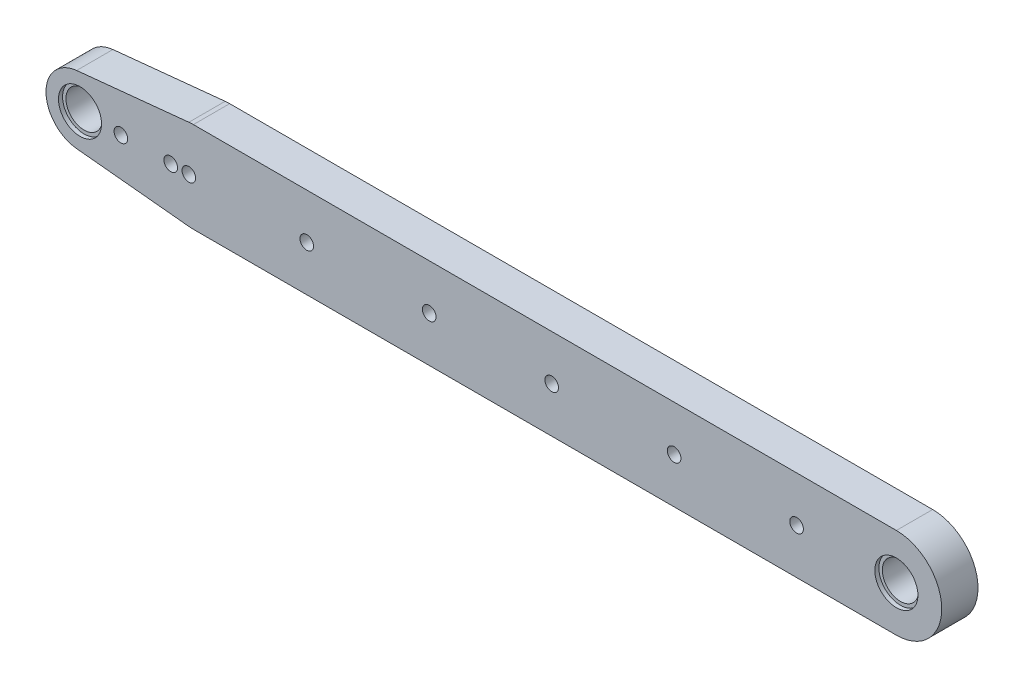
ISO-10303-21;
HEADER;
FILE_DESCRIPTION(('STEP AP214'),'2;1');
FILE_NAME('part.step','',(''),(''),'','','');
FILE_SCHEMA(('AUTOMOTIVE_DESIGN { 1 0 10303 214 1 1 1 1 }'));
ENDSEC;
DATA;
#1=APPLICATION_CONTEXT('core data for automotive mechanical design processes');
#2=APPLICATION_PROTOCOL_DEFINITION('international standard','automotive_design',2000,#1);
#3=PRODUCT_CONTEXT('',#1,'mechanical');
#4=PRODUCT('Part','Part','',(#3));
#5=PRODUCT_RELATED_PRODUCT_CATEGORY('part','',(#4));
#6=PRODUCT_DEFINITION_FORMATION('','',#4);
#7=PRODUCT_DEFINITION_CONTEXT('part definition',#1,'design');
#8=PRODUCT_DEFINITION('design','',#6,#7);
#9=PRODUCT_DEFINITION_SHAPE('','',#8);
#10=(LENGTH_UNIT() NAMED_UNIT(*) SI_UNIT(.MILLI.,.METRE.));
#11=(NAMED_UNIT(*) PLANE_ANGLE_UNIT() SI_UNIT($,.RADIAN.));
#12=(NAMED_UNIT(*) SI_UNIT($,.STERADIAN.) SOLID_ANGLE_UNIT());
#13=UNCERTAINTY_MEASURE_WITH_UNIT(LENGTH_MEASURE(1.E-05),#10,'distance_accuracy_value','');
#14=(GEOMETRIC_REPRESENTATION_CONTEXT(3) GLOBAL_UNCERTAINTY_ASSIGNED_CONTEXT((#13)) GLOBAL_UNIT_ASSIGNED_CONTEXT((#10,
#11,#12)) REPRESENTATION_CONTEXT('',''));
#15=CARTESIAN_POINT('',(0.,0.,0.));
#16=DIRECTION('',(0.,0.,1.));
#17=DIRECTION('',(1.,0.,0.));
#18=AXIS2_PLACEMENT_3D('',#15,#16,#17);
#19=CARTESIAN_POINT('',(0.,10.,8.));
#20=DIRECTION('',(0.,1.,0.));
#21=DIRECTION('',(0.,0.,1.));
#22=AXIS2_PLACEMENT_3D('',#19,#20,#21);
#23=PLANE('',#22);
#24=DIRECTION('',(1.,0.,0.));
#25=VECTOR('',#24,1.);
#26=CARTESIAN_POINT('',(0.,10.,0.));
#27=LINE('',#26,#25);
#28=CARTESIAN_POINT('',(-77.5,10.,0.));
#29=VERTEX_POINT('',#28);
#30=CARTESIAN_POINT('',(77.5,10.,0.));
#31=VERTEX_POINT('',#30);
#32=EDGE_CURVE('E140',#29,#31,#27,.T.);
#33=ORIENTED_EDGE('',*,*,#32,.F.);
#34=DIRECTION('',(0.,0.,-1.));
#35=VECTOR('',#34,1.);
#36=CARTESIAN_POINT('',(-77.5,10.,8.));
#37=LINE('',#36,#35);
#38=CARTESIAN_POINT('',(-77.5,10.,8.));
#39=VERTEX_POINT('',#38);
#40=EDGE_CURVE('E11',#39,#29,#37,.T.);
#41=ORIENTED_EDGE('',*,*,#40,.F.);
#42=DIRECTION('',(1.,0.,0.));
#43=VECTOR('',#42,1.);
#44=CARTESIAN_POINT('',(0.,10.,8.));
#45=LINE('',#44,#43);
#46=CARTESIAN_POINT('',(77.5,10.,8.));
#47=VERTEX_POINT('',#46);
#48=EDGE_CURVE('E157',#39,#47,#45,.T.);
#49=ORIENTED_EDGE('',*,*,#48,.T.);
#50=DIRECTION('',(0.,0.,-1.));
#51=VECTOR('',#50,1.);
#52=CARTESIAN_POINT('',(77.5,10.,8.));
#53=LINE('',#52,#51);
#54=EDGE_CURVE('E96',#47,#31,#53,.T.);
#55=ORIENTED_EDGE('',*,*,#54,.T.);
#56=EDGE_LOOP('',(#33,#41,#49,#55));
#57=FACE_BOUND('',#56,.T.);
#58=ADVANCED_FACE('F45',(#57),#23,.T.);
#59=CARTESIAN_POINT('',(-77.5,0.,8.));
#60=DIRECTION('',(0.,0.,-1.));
#61=DIRECTION('',(-1.,0.,0.));
#62=AXIS2_PLACEMENT_3D('',#59,#60,#61);
#63=CYLINDRICAL_SURFACE('',#62,10.);
#64=CARTESIAN_POINT('',(-77.5,0.,0.));
#65=DIRECTION('',(0.,0.,1.));
#66=DIRECTION('',(1.,0.,0.));
#67=AXIS2_PLACEMENT_3D('',#64,#65,#66);
#68=CIRCLE('',#67,10.);
#69=CARTESIAN_POINT('',(-78.5,9.94987437106622,0.));
#70=VERTEX_POINT('',#69);
#71=EDGE_CURVE('E143',#29,#70,#68,.T.);
#72=ORIENTED_EDGE('',*,*,#71,.T.);
#73=DIRECTION('',(0.,0.,-1.));
#74=VECTOR('',#73,1.);
#75=CARTESIAN_POINT('',(-78.5,9.94987437106622,8.));
#76=LINE('',#75,#74);
#77=CARTESIAN_POINT('',(-78.5,9.94987437106622,8.));
#78=VERTEX_POINT('',#77);
#79=EDGE_CURVE('E53',#78,#70,#76,.T.);
#80=ORIENTED_EDGE('',*,*,#79,.F.);
#81=CARTESIAN_POINT('',(-77.5,0.,8.));
#82=DIRECTION('',(0.,0.,1.));
#83=DIRECTION('',(1.,0.,0.));
#84=AXIS2_PLACEMENT_3D('',#81,#82,#83);
#85=CIRCLE('',#84,10.);
#86=EDGE_CURVE('E126',#39,#78,#85,.T.);
#87=ORIENTED_EDGE('',*,*,#86,.F.);
#88=ORIENTED_EDGE('',*,*,#40,.T.);
#89=EDGE_LOOP('',(#72,#80,#87,#88));
#90=FACE_BOUND('',#89,.T.);
#91=ADVANCED_FACE('F174',(#90),#63,.T.);
#92=CARTESIAN_POINT('',(-1.77499999999999,17.6610270086425,8.));
#93=DIRECTION('',(-0.0999999999999995,0.99498743710662,0.));
#94=DIRECTION('',(-0.99498743710662,-0.0999999999999995,0.));
#95=AXIS2_PLACEMENT_3D('',#92,#93,#94);
#96=PLANE('',#95);
#97=DIRECTION('',(0.99498743710662,0.0999999999999995,0.));
#98=VECTOR('',#97,1.);
#99=CARTESIAN_POINT('',(-1.77499999999999,17.6610270086425,0.));
#100=LINE('',#99,#98);
#101=CARTESIAN_POINT('',(-103.25,7.46240577829968,0.));
#102=VERTEX_POINT('',#101);
#103=EDGE_CURVE('E147',#102,#70,#100,.T.);
#104=ORIENTED_EDGE('',*,*,#103,.F.);
#105=DIRECTION('',(0.,0.,-1.));
#106=VECTOR('',#105,1.);
#107=CARTESIAN_POINT('',(-103.25,7.46240577829968,8.));
#108=LINE('',#107,#106);
#109=CARTESIAN_POINT('',(-103.25,7.46240577829968,8.));
#110=VERTEX_POINT('',#109);
#111=EDGE_CURVE('E164',#110,#102,#108,.T.);
#112=ORIENTED_EDGE('',*,*,#111,.F.);
#113=DIRECTION('',(0.99498743710662,0.0999999999999995,0.));
#114=VECTOR('',#113,1.);
#115=CARTESIAN_POINT('',(-1.77499999999999,17.6610270086425,8.));
#116=LINE('',#115,#114);
#117=EDGE_CURVE('E171',#110,#78,#116,.T.);
#118=ORIENTED_EDGE('',*,*,#117,.T.);
#119=ORIENTED_EDGE('',*,*,#79,.T.);
#120=EDGE_LOOP('',(#104,#112,#118,#119));
#121=FACE_BOUND('',#120,.T.);
#122=ADVANCED_FACE('F169',(#121),#96,.T.);
#123=CARTESIAN_POINT('',(-102.5,0.,8.));
#124=DIRECTION('',(0.,0.,-1.));
#125=DIRECTION('',(-1.,0.,0.));
#126=AXIS2_PLACEMENT_3D('',#123,#124,#125);
#127=CYLINDRICAL_SURFACE('',#126,7.50000000000003);
#128=CARTESIAN_POINT('',(-102.5,0.,0.));
#129=DIRECTION('',(0.,0.,1.));
#130=DIRECTION('',(1.,0.,0.));
#131=AXIS2_PLACEMENT_3D('',#128,#129,#130);
#132=CIRCLE('',#131,7.50000000000003);
#133=CARTESIAN_POINT('',(-103.25,-7.46240577829969,0.));
#134=VERTEX_POINT('',#133);
#135=EDGE_CURVE('E150',#102,#134,#132,.T.);
#136=ORIENTED_EDGE('',*,*,#135,.T.);
#137=DIRECTION('',(0.,0.,-1.));
#138=VECTOR('',#137,1.);
#139=CARTESIAN_POINT('',(-103.25,-7.46240577829969,8.));
#140=LINE('',#139,#138);
#141=CARTESIAN_POINT('',(-103.25,-7.46240577829969,8.));
#142=VERTEX_POINT('',#141);
#143=EDGE_CURVE('E161',#142,#134,#140,.T.);
#144=ORIENTED_EDGE('',*,*,#143,.F.);
#145=CARTESIAN_POINT('',(-102.5,0.,8.));
#146=DIRECTION('',(0.,0.,1.));
#147=DIRECTION('',(1.,0.,0.));
#148=AXIS2_PLACEMENT_3D('',#145,#146,#147);
#149=CIRCLE('',#148,7.50000000000003);
#150=EDGE_CURVE('E185',#110,#142,#149,.T.);
#151=ORIENTED_EDGE('',*,*,#150,.F.);
#152=ORIENTED_EDGE('',*,*,#111,.T.);
#153=EDGE_LOOP('',(#136,#144,#151,#152));
#154=FACE_BOUND('',#153,.T.);
#155=ADVANCED_FACE('F181',(#154),#127,.T.);
#156=CARTESIAN_POINT('',(-1.77499999999998,-17.6610270086425,8.));
#157=DIRECTION('',(0.0999999999999992,0.99498743710662,0.));
#158=DIRECTION('',(-0.99498743710662,0.0999999999999992,0.));
#159=AXIS2_PLACEMENT_3D('',#156,#157,#158);
#160=PLANE('',#159);
#161=DIRECTION('',(0.99498743710662,-0.0999999999999992,0.));
#162=VECTOR('',#161,1.);
#163=CARTESIAN_POINT('',(-1.77499999999998,-17.6610270086425,0.));
#164=LINE('',#163,#162);
#165=CARTESIAN_POINT('',(-78.5,-9.94987437106621,0.));
#166=VERTEX_POINT('',#165);
#167=EDGE_CURVE('E152',#134,#166,#164,.T.);
#168=ORIENTED_EDGE('',*,*,#167,.T.);
#169=DIRECTION('',(0.,0.,-1.));
#170=VECTOR('',#169,1.);
#171=CARTESIAN_POINT('',(-78.5,-9.94987437106621,8.));
#172=LINE('',#171,#170);
#173=CARTESIAN_POINT('',(-78.5,-9.94987437106621,8.));
#174=VERTEX_POINT('',#173);
#175=EDGE_CURVE('E131',#174,#166,#172,.T.);
#176=ORIENTED_EDGE('',*,*,#175,.F.);
#177=DIRECTION('',(0.99498743710662,-0.0999999999999992,0.));
#178=VECTOR('',#177,1.);
#179=CARTESIAN_POINT('',(-1.77499999999998,-17.6610270086425,8.));
#180=LINE('',#179,#178);
#181=EDGE_CURVE('E121',#142,#174,#180,.T.);
#182=ORIENTED_EDGE('',*,*,#181,.F.);
#183=ORIENTED_EDGE('',*,*,#143,.T.);
#184=EDGE_LOOP('',(#168,#176,#182,#183));
#185=FACE_BOUND('',#184,.T.);
#186=ADVANCED_FACE('F184',(#185),#160,.F.);
#187=CARTESIAN_POINT('',(-77.5,-10.,0.));
#188=VERTEX_POINT('',#187);
#189=EDGE_CURVE('E130',#166,#188,#68,.T.);
#190=ORIENTED_EDGE('',*,*,#189,.T.);
#191=DIRECTION('',(0.,0.,-1.));
#192=VECTOR('',#191,1.);
#193=CARTESIAN_POINT('',(-77.5,-10.,8.));
#194=LINE('',#193,#192);
#195=CARTESIAN_POINT('',(-77.5,-10.,8.));
#196=VERTEX_POINT('',#195);
#197=EDGE_CURVE('E127',#196,#188,#194,.T.);
#198=ORIENTED_EDGE('',*,*,#197,.F.);
#199=EDGE_CURVE('E115',#174,#196,#85,.T.);
#200=ORIENTED_EDGE('',*,*,#199,.F.);
#201=ORIENTED_EDGE('',*,*,#175,.T.);
#202=EDGE_LOOP('',(#190,#198,#200,#201));
#203=FACE_BOUND('',#202,.T.);
#204=ADVANCED_FACE('F128',(#203),#63,.T.);
#205=CARTESIAN_POINT('',(0.,-10.,8.));
#206=DIRECTION('',(0.,1.,0.));
#207=DIRECTION('',(0.,0.,1.));
#208=AXIS2_PLACEMENT_3D('',#205,#206,#207);
#209=PLANE('',#208);
#210=DIRECTION('',(1.,0.,0.));
#211=VECTOR('',#210,1.);
#212=CARTESIAN_POINT('',(0.,-10.,0.));
#213=LINE('',#212,#211);
#214=CARTESIAN_POINT('',(77.5,-10.,0.));
#215=VERTEX_POINT('',#214);
#216=EDGE_CURVE('E89',#188,#215,#213,.T.);
#217=ORIENTED_EDGE('',*,*,#216,.T.);
#218=DIRECTION('',(0.,0.,-1.));
#219=VECTOR('',#218,1.);
#220=CARTESIAN_POINT('',(77.5,-10.,8.));
#221=LINE('',#220,#219);
#222=CARTESIAN_POINT('',(77.5,-10.,8.));
#223=VERTEX_POINT('',#222);
#224=EDGE_CURVE('E132',#223,#215,#221,.T.);
#225=ORIENTED_EDGE('',*,*,#224,.F.);
#226=DIRECTION('',(1.,0.,0.));
#227=VECTOR('',#226,1.);
#228=CARTESIAN_POINT('',(0.,-10.,8.));
#229=LINE('',#228,#227);
#230=EDGE_CURVE('E119',#196,#223,#229,.T.);
#231=ORIENTED_EDGE('',*,*,#230,.F.);
#232=ORIENTED_EDGE('',*,*,#197,.T.);
#233=EDGE_LOOP('',(#217,#225,#231,#232));
#234=FACE_BOUND('',#233,.T.);
#235=ADVANCED_FACE('F134',(#234),#209,.F.);
#236=CARTESIAN_POINT('',(77.5,0.,8.));
#237=DIRECTION('',(0.,0.,-1.));
#238=DIRECTION('',(-1.,0.,0.));
#239=AXIS2_PLACEMENT_3D('',#236,#237,#238);
#240=CYLINDRICAL_SURFACE('',#239,10.);
#241=CARTESIAN_POINT('',(77.5,0.,0.));
#242=DIRECTION('',(0.,0.,1.));
#243=DIRECTION('',(1.,0.,0.));
#244=AXIS2_PLACEMENT_3D('',#241,#242,#243);
#245=CIRCLE('',#244,10.);
#246=EDGE_CURVE('E155',#215,#31,#245,.T.);
#247=ORIENTED_EDGE('',*,*,#246,.T.);
#248=ORIENTED_EDGE('',*,*,#54,.F.);
#249=CARTESIAN_POINT('',(77.5,0.,8.));
#250=DIRECTION('',(0.,0.,1.));
#251=DIRECTION('',(1.,0.,0.));
#252=AXIS2_PLACEMENT_3D('',#249,#250,#251);
#253=CIRCLE('',#252,10.);
#254=EDGE_CURVE('E61',#223,#47,#253,.T.);
#255=ORIENTED_EDGE('',*,*,#254,.F.);
#256=ORIENTED_EDGE('',*,*,#224,.T.);
#257=EDGE_LOOP('',(#247,#248,#255,#256));
#258=FACE_BOUND('',#257,.T.);
#259=ADVANCED_FACE('F281',(#258),#240,.T.);
#260=CARTESIAN_POINT('',(0.,0.,8.));
#261=DIRECTION('',(0.,0.,1.));
#262=DIRECTION('',(1.,0.,0.));
#263=AXIS2_PLACEMENT_3D('',#260,#261,#262);
#264=PLANE('',#263);
#265=CARTESIAN_POINT('',(-52.5,0.,8.));
#266=DIRECTION('',(0.,0.,1.));
#267=DIRECTION('',(1.,0.,0.));
#268=AXIS2_PLACEMENT_3D('',#265,#266,#267);
#269=CIRCLE('',#268,1.5);
#270=CARTESIAN_POINT('',(-51.,0.,8.));
#271=VERTEX_POINT('',#270);
#272=EDGE_CURVE('E230',#271,#271,#269,.T.);
#273=ORIENTED_EDGE('',*,*,#272,.F.);
#274=EDGE_LOOP('',(#273));
#275=FACE_BOUND('',#274,.T.);
#276=CARTESIAN_POINT('',(-25.5,0.,8.));
#277=DIRECTION('',(0.,0.,1.));
#278=DIRECTION('',(1.,0.,0.));
#279=AXIS2_PLACEMENT_3D('',#276,#277,#278);
#280=CIRCLE('',#279,1.5);
#281=CARTESIAN_POINT('',(-24.,0.,8.));
#282=VERTEX_POINT('',#281);
#283=EDGE_CURVE('E233',#282,#282,#280,.T.);
#284=ORIENTED_EDGE('',*,*,#283,.F.);
#285=EDGE_LOOP('',(#284));
#286=FACE_BOUND('',#285,.T.);
#287=CARTESIAN_POINT('',(1.50000000000001,0.,8.));
#288=DIRECTION('',(0.,0.,1.));
#289=DIRECTION('',(1.,0.,0.));
#290=AXIS2_PLACEMENT_3D('',#287,#288,#289);
#291=CIRCLE('',#290,1.5);
#292=CARTESIAN_POINT('',(3.00000000000001,0.,8.));
#293=VERTEX_POINT('',#292);
#294=EDGE_CURVE('E236',#293,#293,#291,.T.);
#295=ORIENTED_EDGE('',*,*,#294,.F.);
#296=EDGE_LOOP('',(#295));
#297=FACE_BOUND('',#296,.T.);
#298=CARTESIAN_POINT('',(28.5,0.,8.));
#299=DIRECTION('',(0.,0.,1.));
#300=DIRECTION('',(1.,0.,0.));
#301=AXIS2_PLACEMENT_3D('',#298,#299,#300);
#302=CIRCLE('',#301,1.5);
#303=CARTESIAN_POINT('',(30.,0.,8.));
#304=VERTEX_POINT('',#303);
#305=EDGE_CURVE('E239',#304,#304,#302,.T.);
#306=ORIENTED_EDGE('',*,*,#305,.F.);
#307=EDGE_LOOP('',(#306));
#308=FACE_BOUND('',#307,.T.);
#309=CARTESIAN_POINT('',(55.5,0.,8.));
#310=DIRECTION('',(0.,0.,1.));
#311=DIRECTION('',(1.,0.,0.));
#312=AXIS2_PLACEMENT_3D('',#309,#310,#311);
#313=CIRCLE('',#312,1.5);
#314=CARTESIAN_POINT('',(57.,0.,8.));
#315=VERTEX_POINT('',#314);
#316=EDGE_CURVE('E242',#315,#315,#313,.T.);
#317=ORIENTED_EDGE('',*,*,#316,.F.);
#318=EDGE_LOOP('',(#317));
#319=FACE_BOUND('',#318,.T.);
#320=CARTESIAN_POINT('',(-102.5,0.,8.));
#321=DIRECTION('',(0.,0.,1.));
#322=DIRECTION('',(1.,0.,0.));
#323=AXIS2_PLACEMENT_3D('',#320,#321,#322);
#324=CIRCLE('',#323,4.75);
#325=CARTESIAN_POINT('',(-97.75,0.,8.));
#326=VERTEX_POINT('',#325);
#327=EDGE_CURVE('E227',#326,#326,#324,.T.);
#328=ORIENTED_EDGE('',*,*,#327,.F.);
#329=EDGE_LOOP('',(#328));
#330=FACE_BOUND('',#329,.T.);
#331=CARTESIAN_POINT('',(77.5,0.,8.));
#332=DIRECTION('',(0.,0.,1.));
#333=DIRECTION('',(1.,0.,0.));
#334=AXIS2_PLACEMENT_3D('',#331,#332,#333);
#335=CIRCLE('',#334,4.75);
#336=CARTESIAN_POINT('',(82.25,0.,8.));
#337=VERTEX_POINT('',#336);
#338=EDGE_CURVE('E215',#337,#337,#335,.T.);
#339=ORIENTED_EDGE('',*,*,#338,.F.);
#340=EDGE_LOOP('',(#339));
#341=FACE_BOUND('',#340,.T.);
#342=CARTESIAN_POINT('',(-93.5,0.,8.));
#343=DIRECTION('',(0.,0.,1.));
#344=DIRECTION('',(1.,0.,0.));
#345=AXIS2_PLACEMENT_3D('',#342,#343,#344);
#346=CIRCLE('',#345,1.5);
#347=CARTESIAN_POINT('',(-92.,0.,8.));
#348=VERTEX_POINT('',#347);
#349=EDGE_CURVE('E203',#348,#348,#346,.T.);
#350=ORIENTED_EDGE('',*,*,#349,.F.);
#351=EDGE_LOOP('',(#350));
#352=FACE_BOUND('',#351,.T.);
#353=CARTESIAN_POINT('',(-82.5,0.,8.));
#354=DIRECTION('',(0.,0.,1.));
#355=DIRECTION('',(1.,0.,0.));
#356=AXIS2_PLACEMENT_3D('',#353,#354,#355);
#357=CIRCLE('',#356,1.5);
#358=CARTESIAN_POINT('',(-81.,0.,8.));
#359=VERTEX_POINT('',#358);
#360=EDGE_CURVE('E197',#359,#359,#357,.T.);
#361=ORIENTED_EDGE('',*,*,#360,.F.);
#362=EDGE_LOOP('',(#361));
#363=FACE_BOUND('',#362,.T.);
#364=CARTESIAN_POINT('',(-78.5,0.,8.));
#365=DIRECTION('',(0.,0.,1.));
#366=DIRECTION('',(1.,0.,0.));
#367=AXIS2_PLACEMENT_3D('',#364,#365,#366);
#368=CIRCLE('',#367,1.5);
#369=CARTESIAN_POINT('',(-77.,0.,8.));
#370=VERTEX_POINT('',#369);
#371=EDGE_CURVE('E191',#370,#370,#368,.T.);
#372=ORIENTED_EDGE('',*,*,#371,.F.);
#373=EDGE_LOOP('',(#372));
#374=FACE_BOUND('',#373,.T.);
#375=ORIENTED_EDGE('',*,*,#48,.F.);
#376=ORIENTED_EDGE('',*,*,#86,.T.);
#377=ORIENTED_EDGE('',*,*,#117,.F.);
#378=ORIENTED_EDGE('',*,*,#150,.T.);
#379=ORIENTED_EDGE('',*,*,#181,.T.);
#380=ORIENTED_EDGE('',*,*,#199,.T.);
#381=ORIENTED_EDGE('',*,*,#230,.T.);
#382=ORIENTED_EDGE('',*,*,#254,.T.);
#383=EDGE_LOOP('',(#375,#376,#377,#378,#379,#380,#381,#382));
#384=FACE_BOUND('',#383,.T.);
#385=ADVANCED_FACE('F117',(#275,#286,#297,#308,#319,#330,#341,#352,#363,#374,#384),#264,.T.);
#386=CARTESIAN_POINT('',(0.,0.,0.));
#387=DIRECTION('',(0.,0.,1.));
#388=DIRECTION('',(1.,0.,0.));
#389=AXIS2_PLACEMENT_3D('',#386,#387,#388);
#390=PLANE('',#389);
#391=CARTESIAN_POINT('',(-52.5,0.,0.));
#392=DIRECTION('',(0.,0.,1.));
#393=DIRECTION('',(1.,0.,0.));
#394=AXIS2_PLACEMENT_3D('',#391,#392,#393);
#395=CIRCLE('',#394,1.5);
#396=CARTESIAN_POINT('',(-51.,0.,0.));
#397=VERTEX_POINT('',#396);
#398=EDGE_CURVE('E245',#397,#397,#395,.T.);
#399=ORIENTED_EDGE('',*,*,#398,.T.);
#400=EDGE_LOOP('',(#399));
#401=FACE_BOUND('',#400,.T.);
#402=CARTESIAN_POINT('',(-25.5,0.,0.));
#403=DIRECTION('',(0.,0.,1.));
#404=DIRECTION('',(1.,0.,0.));
#405=AXIS2_PLACEMENT_3D('',#402,#403,#404);
#406=CIRCLE('',#405,1.5);
#407=CARTESIAN_POINT('',(-24.,0.,0.));
#408=VERTEX_POINT('',#407);
#409=EDGE_CURVE('E255',#408,#408,#406,.T.);
#410=ORIENTED_EDGE('',*,*,#409,.T.);
#411=EDGE_LOOP('',(#410));
#412=FACE_BOUND('',#411,.T.);
#413=CARTESIAN_POINT('',(1.50000000000001,0.,0.));
#414=DIRECTION('',(0.,0.,1.));
#415=DIRECTION('',(1.,0.,0.));
#416=AXIS2_PLACEMENT_3D('',#413,#414,#415);
#417=CIRCLE('',#416,1.5);
#418=CARTESIAN_POINT('',(3.00000000000001,0.,0.));
#419=VERTEX_POINT('',#418);
#420=EDGE_CURVE('E252',#419,#419,#417,.T.);
#421=ORIENTED_EDGE('',*,*,#420,.T.);
#422=EDGE_LOOP('',(#421));
#423=FACE_BOUND('',#422,.T.);
#424=CARTESIAN_POINT('',(28.5,0.,0.));
#425=DIRECTION('',(0.,0.,1.));
#426=DIRECTION('',(1.,0.,0.));
#427=AXIS2_PLACEMENT_3D('',#424,#425,#426);
#428=CIRCLE('',#427,1.5);
#429=CARTESIAN_POINT('',(30.,0.,0.));
#430=VERTEX_POINT('',#429);
#431=EDGE_CURVE('E249',#430,#430,#428,.T.);
#432=ORIENTED_EDGE('',*,*,#431,.T.);
#433=EDGE_LOOP('',(#432));
#434=FACE_BOUND('',#433,.T.);
#435=CARTESIAN_POINT('',(55.5,0.,0.));
#436=DIRECTION('',(0.,0.,1.));
#437=DIRECTION('',(1.,0.,0.));
#438=AXIS2_PLACEMENT_3D('',#435,#436,#437);
#439=CIRCLE('',#438,1.5);
#440=CARTESIAN_POINT('',(57.,0.,0.));
#441=VERTEX_POINT('',#440);
#442=EDGE_CURVE('E246',#441,#441,#439,.T.);
#443=ORIENTED_EDGE('',*,*,#442,.T.);
#444=EDGE_LOOP('',(#443));
#445=FACE_BOUND('',#444,.T.);
#446=CARTESIAN_POINT('',(-102.5,0.,0.));
#447=DIRECTION('',(0.,0.,1.));
#448=DIRECTION('',(1.,0.,0.));
#449=AXIS2_PLACEMENT_3D('',#446,#447,#448);
#450=CIRCLE('',#449,4.);
#451=CARTESIAN_POINT('',(-98.5,0.,0.));
#452=VERTEX_POINT('',#451);
#453=EDGE_CURVE('E218',#452,#452,#450,.T.);
#454=ORIENTED_EDGE('',*,*,#453,.T.);
#455=EDGE_LOOP('',(#454));
#456=FACE_BOUND('',#455,.T.);
#457=CARTESIAN_POINT('',(77.5,0.,0.));
#458=DIRECTION('',(0.,0.,1.));
#459=DIRECTION('',(1.,0.,0.));
#460=AXIS2_PLACEMENT_3D('',#457,#458,#459);
#461=CIRCLE('',#460,4.);
#462=CARTESIAN_POINT('',(81.5,0.,0.));
#463=VERTEX_POINT('',#462);
#464=EDGE_CURVE('E206',#463,#463,#461,.T.);
#465=ORIENTED_EDGE('',*,*,#464,.T.);
#466=EDGE_LOOP('',(#465));
#467=FACE_BOUND('',#466,.T.);
#468=CARTESIAN_POINT('',(-93.5,0.,0.));
#469=DIRECTION('',(0.,0.,1.));
#470=DIRECTION('',(1.,0.,0.));
#471=AXIS2_PLACEMENT_3D('',#468,#469,#470);
#472=CIRCLE('',#471,1.5);
#473=CARTESIAN_POINT('',(-92.,0.,0.));
#474=VERTEX_POINT('',#473);
#475=EDGE_CURVE('E200',#474,#474,#472,.T.);
#476=ORIENTED_EDGE('',*,*,#475,.T.);
#477=EDGE_LOOP('',(#476));
#478=FACE_BOUND('',#477,.T.);
#479=CARTESIAN_POINT('',(-82.5,0.,0.));
#480=DIRECTION('',(0.,0.,1.));
#481=DIRECTION('',(1.,0.,0.));
#482=AXIS2_PLACEMENT_3D('',#479,#480,#481);
#483=CIRCLE('',#482,1.5);
#484=CARTESIAN_POINT('',(-81.,0.,0.));
#485=VERTEX_POINT('',#484);
#486=EDGE_CURVE('E194',#485,#485,#483,.T.);
#487=ORIENTED_EDGE('',*,*,#486,.T.);
#488=EDGE_LOOP('',(#487));
#489=FACE_BOUND('',#488,.T.);
#490=CARTESIAN_POINT('',(-78.5,0.,0.));
#491=DIRECTION('',(0.,0.,1.));
#492=DIRECTION('',(1.,0.,0.));
#493=AXIS2_PLACEMENT_3D('',#490,#491,#492);
#494=CIRCLE('',#493,1.5);
#495=CARTESIAN_POINT('',(-77.,0.,0.));
#496=VERTEX_POINT('',#495);
#497=EDGE_CURVE('E144',#496,#496,#494,.T.);
#498=ORIENTED_EDGE('',*,*,#497,.T.);
#499=EDGE_LOOP('',(#498));
#500=FACE_BOUND('',#499,.T.);
#501=ORIENTED_EDGE('',*,*,#32,.T.);
#502=ORIENTED_EDGE('',*,*,#246,.F.);
#503=ORIENTED_EDGE('',*,*,#216,.F.);
#504=ORIENTED_EDGE('',*,*,#189,.F.);
#505=ORIENTED_EDGE('',*,*,#167,.F.);
#506=ORIENTED_EDGE('',*,*,#135,.F.);
#507=ORIENTED_EDGE('',*,*,#103,.T.);
#508=ORIENTED_EDGE('',*,*,#71,.F.);
#509=EDGE_LOOP('',(#501,#502,#503,#504,#505,#506,#507,#508));
#510=FACE_BOUND('',#509,.T.);
#511=ADVANCED_FACE('F177',(#401,#412,#423,#434,#445,#456,#467,#478,#489,#500,#510),#390,.F.);
#512=CARTESIAN_POINT('',(-78.5,0.,8.));
#513=DIRECTION('',(0.,0.,1.));
#514=DIRECTION('',(1.,0.,0.));
#515=AXIS2_PLACEMENT_3D('',#512,#513,#514);
#516=CYLINDRICAL_SURFACE('',#515,1.5);
#517=ORIENTED_EDGE('',*,*,#497,.F.);
#518=EDGE_LOOP('',(#517));
#519=FACE_BOUND('',#518,.T.);
#520=ORIENTED_EDGE('',*,*,#371,.T.);
#521=EDGE_LOOP('',(#520));
#522=FACE_BOUND('',#521,.T.);
#523=ADVANCED_FACE('F339',(#519,#522),#516,.F.);
#524=CARTESIAN_POINT('',(-82.5,0.,8.));
#525=DIRECTION('',(0.,0.,1.));
#526=DIRECTION('',(1.,0.,0.));
#527=AXIS2_PLACEMENT_3D('',#524,#525,#526);
#528=CYLINDRICAL_SURFACE('',#527,1.5);
#529=ORIENTED_EDGE('',*,*,#486,.F.);
#530=EDGE_LOOP('',(#529));
#531=FACE_BOUND('',#530,.T.);
#532=ORIENTED_EDGE('',*,*,#360,.T.);
#533=EDGE_LOOP('',(#532));
#534=FACE_BOUND('',#533,.T.);
#535=ADVANCED_FACE('F348',(#531,#534),#528,.F.);
#536=CARTESIAN_POINT('',(-93.5,0.,8.));
#537=DIRECTION('',(0.,0.,1.));
#538=DIRECTION('',(1.,0.,0.));
#539=AXIS2_PLACEMENT_3D('',#536,#537,#538);
#540=CYLINDRICAL_SURFACE('',#539,1.5);
#541=ORIENTED_EDGE('',*,*,#475,.F.);
#542=EDGE_LOOP('',(#541));
#543=FACE_BOUND('',#542,.T.);
#544=ORIENTED_EDGE('',*,*,#349,.T.);
#545=EDGE_LOOP('',(#544));
#546=FACE_BOUND('',#545,.T.);
#547=ADVANCED_FACE('F357',(#543,#546),#540,.F.);
#548=CARTESIAN_POINT('',(77.5,0.,8.));
#549=DIRECTION('',(0.,0.,1.));
#550=DIRECTION('',(1.,0.,0.));
#551=AXIS2_PLACEMENT_3D('',#548,#549,#550);
#552=CYLINDRICAL_SURFACE('',#551,4.);
#553=ORIENTED_EDGE('',*,*,#464,.F.);
#554=EDGE_LOOP('',(#553));
#555=FACE_BOUND('',#554,.T.);
#556=CARTESIAN_POINT('',(77.5,0.,7.1));
#557=DIRECTION('',(0.,0.,1.));
#558=DIRECTION('',(1.,0.,0.));
#559=AXIS2_PLACEMENT_3D('',#556,#557,#558);
#560=CIRCLE('',#559,4.);
#561=CARTESIAN_POINT('',(81.5,0.,7.1));
#562=VERTEX_POINT('',#561);
#563=EDGE_CURVE('E209',#562,#562,#560,.T.);
#564=ORIENTED_EDGE('',*,*,#563,.T.);
#565=EDGE_LOOP('',(#564));
#566=FACE_BOUND('',#565,.T.);
#567=ADVANCED_FACE('F367',(#555,#566),#552,.F.);
#568=CARTESIAN_POINT('',(81.5,0.,7.1));
#569=DIRECTION('',(0.,0.,-1.));
#570=DIRECTION('',(-1.,0.,0.));
#571=AXIS2_PLACEMENT_3D('',#568,#569,#570);
#572=PLANE('',#571);
#573=ORIENTED_EDGE('',*,*,#563,.F.);
#574=EDGE_LOOP('',(#573));
#575=FACE_BOUND('',#574,.T.);
#576=CARTESIAN_POINT('',(77.5,0.,7.1));
#577=DIRECTION('',(0.,0.,1.));
#578=DIRECTION('',(1.,0.,0.));
#579=AXIS2_PLACEMENT_3D('',#576,#577,#578);
#580=CIRCLE('',#579,4.75);
#581=CARTESIAN_POINT('',(82.25,0.,7.1));
#582=VERTEX_POINT('',#581);
#583=EDGE_CURVE('E212',#582,#582,#580,.T.);
#584=ORIENTED_EDGE('',*,*,#583,.T.);
#585=EDGE_LOOP('',(#584));
#586=FACE_BOUND('',#585,.T.);
#587=ADVANCED_FACE('F377',(#575,#586),#572,.F.);
#588=CARTESIAN_POINT('',(77.5,0.,8.));
#589=DIRECTION('',(0.,0.,1.));
#590=DIRECTION('',(1.,0.,0.));
#591=AXIS2_PLACEMENT_3D('',#588,#589,#590);
#592=CYLINDRICAL_SURFACE('',#591,4.75);
#593=ORIENTED_EDGE('',*,*,#583,.F.);
#594=EDGE_LOOP('',(#593));
#595=FACE_BOUND('',#594,.T.);
#596=ORIENTED_EDGE('',*,*,#338,.T.);
#597=EDGE_LOOP('',(#596));
#598=FACE_BOUND('',#597,.T.);
#599=ADVANCED_FACE('F387',(#595,#598),#592,.F.);
#600=CARTESIAN_POINT('',(-102.5,0.,8.));
#601=DIRECTION('',(0.,0.,1.));
#602=DIRECTION('',(1.,0.,0.));
#603=AXIS2_PLACEMENT_3D('',#600,#601,#602);
#604=CYLINDRICAL_SURFACE('',#603,4.);
#605=ORIENTED_EDGE('',*,*,#453,.F.);
#606=EDGE_LOOP('',(#605));
#607=FACE_BOUND('',#606,.T.);
#608=CARTESIAN_POINT('',(-102.5,0.,7.1));
#609=DIRECTION('',(0.,0.,1.));
#610=DIRECTION('',(1.,0.,0.));
#611=AXIS2_PLACEMENT_3D('',#608,#609,#610);
#612=CIRCLE('',#611,4.);
#613=CARTESIAN_POINT('',(-98.5,0.,7.1));
#614=VERTEX_POINT('',#613);
#615=EDGE_CURVE('E221',#614,#614,#612,.T.);
#616=ORIENTED_EDGE('',*,*,#615,.T.);
#617=EDGE_LOOP('',(#616));
#618=FACE_BOUND('',#617,.T.);
#619=ADVANCED_FACE('F397',(#607,#618),#604,.F.);
#620=CARTESIAN_POINT('',(-98.5,0.,7.1));
#621=DIRECTION('',(0.,0.,-1.));
#622=DIRECTION('',(-1.,0.,0.));
#623=AXIS2_PLACEMENT_3D('',#620,#621,#622);
#624=PLANE('',#623);
#625=ORIENTED_EDGE('',*,*,#615,.F.);
#626=EDGE_LOOP('',(#625));
#627=FACE_BOUND('',#626,.T.);
#628=CARTESIAN_POINT('',(-102.5,0.,7.1));
#629=DIRECTION('',(0.,0.,1.));
#630=DIRECTION('',(1.,0.,0.));
#631=AXIS2_PLACEMENT_3D('',#628,#629,#630);
#632=CIRCLE('',#631,4.75);
#633=CARTESIAN_POINT('',(-97.75,0.,7.1));
#634=VERTEX_POINT('',#633);
#635=EDGE_CURVE('E224',#634,#634,#632,.T.);
#636=ORIENTED_EDGE('',*,*,#635,.T.);
#637=EDGE_LOOP('',(#636));
#638=FACE_BOUND('',#637,.T.);
#639=ADVANCED_FACE('F407',(#627,#638),#624,.F.);
#640=CARTESIAN_POINT('',(-102.5,0.,8.));
#641=DIRECTION('',(0.,0.,1.));
#642=DIRECTION('',(1.,0.,0.));
#643=AXIS2_PLACEMENT_3D('',#640,#641,#642);
#644=CYLINDRICAL_SURFACE('',#643,4.75);
#645=ORIENTED_EDGE('',*,*,#635,.F.);
#646=EDGE_LOOP('',(#645));
#647=FACE_BOUND('',#646,.T.);
#648=ORIENTED_EDGE('',*,*,#327,.T.);
#649=EDGE_LOOP('',(#648));
#650=FACE_BOUND('',#649,.T.);
#651=ADVANCED_FACE('F417',(#647,#650),#644,.F.);
#652=CARTESIAN_POINT('',(55.5,0.,0.));
#653=DIRECTION('',(0.,0.,1.));
#654=DIRECTION('',(1.,0.,0.));
#655=AXIS2_PLACEMENT_3D('',#652,#653,#654);
#656=CYLINDRICAL_SURFACE('',#655,1.5);
#657=ORIENTED_EDGE('',*,*,#316,.T.);
#658=EDGE_LOOP('',(#657));
#659=FACE_BOUND('',#658,.T.);
#660=ORIENTED_EDGE('',*,*,#442,.F.);
#661=EDGE_LOOP('',(#660));
#662=FACE_BOUND('',#661,.T.);
#663=ADVANCED_FACE('F426',(#659,#662),#656,.F.);
#664=CARTESIAN_POINT('',(28.5,0.,0.));
#665=DIRECTION('',(0.,0.,1.));
#666=DIRECTION('',(1.,0.,0.));
#667=AXIS2_PLACEMENT_3D('',#664,#665,#666);
#668=CYLINDRICAL_SURFACE('',#667,1.5);
#669=ORIENTED_EDGE('',*,*,#305,.T.);
#670=EDGE_LOOP('',(#669));
#671=FACE_BOUND('',#670,.T.);
#672=ORIENTED_EDGE('',*,*,#431,.F.);
#673=EDGE_LOOP('',(#672));
#674=FACE_BOUND('',#673,.T.);
#675=ADVANCED_FACE('F435',(#671,#674),#668,.F.);
#676=CARTESIAN_POINT('',(1.50000000000001,0.,0.));
#677=DIRECTION('',(0.,0.,1.));
#678=DIRECTION('',(1.,0.,0.));
#679=AXIS2_PLACEMENT_3D('',#676,#677,#678);
#680=CYLINDRICAL_SURFACE('',#679,1.5);
#681=ORIENTED_EDGE('',*,*,#294,.T.);
#682=EDGE_LOOP('',(#681));
#683=FACE_BOUND('',#682,.T.);
#684=ORIENTED_EDGE('',*,*,#420,.F.);
#685=EDGE_LOOP('',(#684));
#686=FACE_BOUND('',#685,.T.);
#687=ADVANCED_FACE('F271',(#683,#686),#680,.F.);
#688=CARTESIAN_POINT('',(-25.5,0.,0.));
#689=DIRECTION('',(0.,0.,1.));
#690=DIRECTION('',(1.,0.,0.));
#691=AXIS2_PLACEMENT_3D('',#688,#689,#690);
#692=CYLINDRICAL_SURFACE('',#691,1.5);
#693=ORIENTED_EDGE('',*,*,#283,.T.);
#694=EDGE_LOOP('',(#693));
#695=FACE_BOUND('',#694,.T.);
#696=ORIENTED_EDGE('',*,*,#409,.F.);
#697=EDGE_LOOP('',(#696));
#698=FACE_BOUND('',#697,.T.);
#699=ADVANCED_FACE('F265',(#695,#698),#692,.F.);
#700=CARTESIAN_POINT('',(-52.5,0.,0.));
#701=DIRECTION('',(0.,0.,1.));
#702=DIRECTION('',(1.,0.,0.));
#703=AXIS2_PLACEMENT_3D('',#700,#701,#702);
#704=CYLINDRICAL_SURFACE('',#703,1.5);
#705=ORIENTED_EDGE('',*,*,#272,.T.);
#706=EDGE_LOOP('',(#705));
#707=FACE_BOUND('',#706,.T.);
#708=ORIENTED_EDGE('',*,*,#398,.F.);
#709=EDGE_LOOP('',(#708));
#710=FACE_BOUND('',#709,.T.);
#711=ADVANCED_FACE('F263',(#707,#710),#704,.F.);
#712=CLOSED_SHELL('',(#58,#91,#122,#155,#186,#204,#235,#259,#385,#511,#523,#535,#547,#567,#587,
#599,#619,#639,#651,#663,#675,#687,#699,#711));
#713=MANIFOLD_SOLID_BREP('B2',#712);
#714=ADVANCED_BREP_SHAPE_REPRESENTATION('',(#18,#713),#14);
#715=SHAPE_DEFINITION_REPRESENTATION(#9,#714);
ENDSEC;
END-ISO-10303-21;
